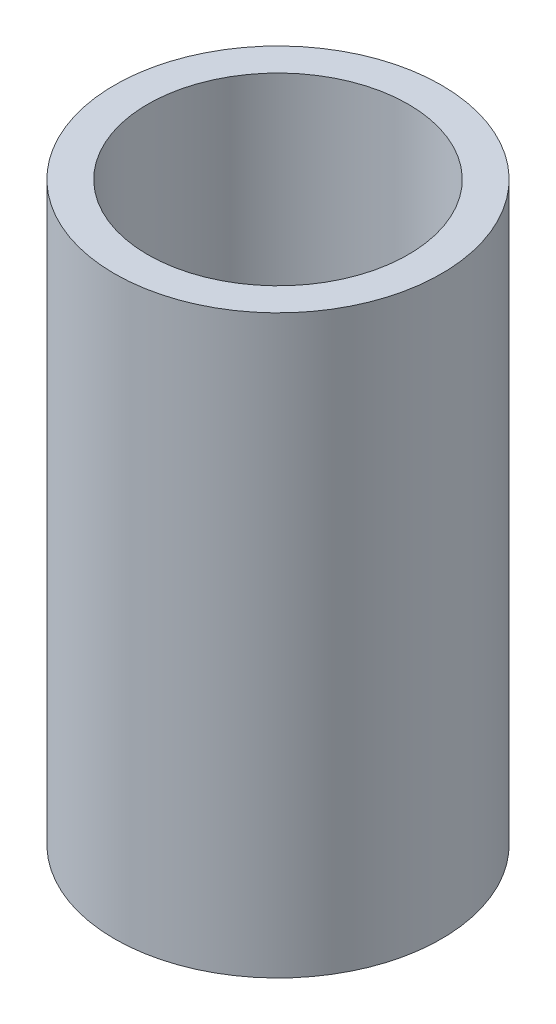
ISO-10303-21;
HEADER;
FILE_DESCRIPTION(('STEP AP214'),'2;1');
FILE_NAME('part.step','',(''),(''),'','','');
FILE_SCHEMA(('AUTOMOTIVE_DESIGN { 1 0 10303 214 1 1 1 1 }'));
ENDSEC;
DATA;
#1=APPLICATION_CONTEXT('core data for automotive mechanical design processes');
#2=APPLICATION_PROTOCOL_DEFINITION('international standard','automotive_design',2000,#1);
#3=PRODUCT_CONTEXT('',#1,'mechanical');
#4=PRODUCT('Part','Part','',(#3));
#5=PRODUCT_RELATED_PRODUCT_CATEGORY('part','',(#4));
#6=PRODUCT_DEFINITION_FORMATION('','',#4);
#7=PRODUCT_DEFINITION_CONTEXT('part definition',#1,'design');
#8=PRODUCT_DEFINITION('design','',#6,#7);
#9=PRODUCT_DEFINITION_SHAPE('','',#8);
#10=(LENGTH_UNIT() NAMED_UNIT(*) SI_UNIT(.MILLI.,.METRE.));
#11=(NAMED_UNIT(*) PLANE_ANGLE_UNIT() SI_UNIT($,.RADIAN.));
#12=(NAMED_UNIT(*) SI_UNIT($,.STERADIAN.) SOLID_ANGLE_UNIT());
#13=UNCERTAINTY_MEASURE_WITH_UNIT(LENGTH_MEASURE(1.E-05),#10,'distance_accuracy_value','');
#14=(GEOMETRIC_REPRESENTATION_CONTEXT(3) GLOBAL_UNCERTAINTY_ASSIGNED_CONTEXT((#13)) GLOBAL_UNIT_ASSIGNED_CONTEXT((#10,
#11,#12)) REPRESENTATION_CONTEXT('',''));
#15=CARTESIAN_POINT('',(0.,0.,0.));
#16=DIRECTION('',(0.,0.,1.));
#17=DIRECTION('',(1.,0.,0.));
#18=AXIS2_PLACEMENT_3D('',#15,#16,#17);
#19=CARTESIAN_POINT('',(0.,70.4902763819376,0.));
#20=DIRECTION('',(0.,-1.,0.));
#21=DIRECTION('',(0.,0.,-1.));
#22=AXIS2_PLACEMENT_3D('',#19,#20,#21);
#23=CYLINDRICAL_SURFACE('',#22,20.);
#24=CARTESIAN_POINT('',(0.,70.4902763819376,0.));
#25=DIRECTION('',(0.,1.,0.));
#26=DIRECTION('',(0.,0.,1.));
#27=AXIS2_PLACEMENT_3D('',#24,#25,#26);
#28=CIRCLE('',#27,20.);
#29=CARTESIAN_POINT('',(0.,70.4902763819376,20.));
#30=VERTEX_POINT('',#29);
#31=EDGE_CURVE('E10',#30,#30,#28,.T.);
#32=ORIENTED_EDGE('',*,*,#31,.F.);
#33=EDGE_LOOP('',(#32));
#34=FACE_BOUND('',#33,.T.);
#35=CARTESIAN_POINT('',(0.,0.,0.));
#36=DIRECTION('',(0.,1.,0.));
#37=DIRECTION('',(0.,0.,1.));
#38=AXIS2_PLACEMENT_3D('',#35,#36,#37);
#39=CIRCLE('',#38,20.);
#40=CARTESIAN_POINT('',(0.,0.,20.));
#41=VERTEX_POINT('',#40);
#42=EDGE_CURVE('E37',#41,#41,#39,.T.);
#43=ORIENTED_EDGE('',*,*,#42,.T.);
#44=EDGE_LOOP('',(#43));
#45=FACE_BOUND('',#44,.T.);
#46=ADVANCED_FACE('F40',(#34,#45),#23,.T.);
#47=CARTESIAN_POINT('',(0.,70.4902763819376,0.));
#48=DIRECTION('',(0.,1.,0.));
#49=DIRECTION('',(0.,0.,1.));
#50=AXIS2_PLACEMENT_3D('',#47,#48,#49);
#51=PLANE('',#50);
#52=CARTESIAN_POINT('',(0.,70.4902763819376,0.));
#53=DIRECTION('',(0.,1.,0.));
#54=DIRECTION('',(0.,0.,1.));
#55=AXIS2_PLACEMENT_3D('',#52,#53,#54);
#56=CIRCLE('',#55,15.947581154964);
#57=CARTESIAN_POINT('',(0.,70.4902763819376,15.947581154964));
#58=VERTEX_POINT('',#57);
#59=EDGE_CURVE('E50',#58,#58,#56,.T.);
#60=ORIENTED_EDGE('',*,*,#59,.F.);
#61=EDGE_LOOP('',(#60));
#62=FACE_BOUND('',#61,.T.);
#63=ORIENTED_EDGE('',*,*,#31,.T.);
#64=EDGE_LOOP('',(#63));
#65=FACE_BOUND('',#64,.T.);
#66=ADVANCED_FACE('F59',(#62,#65),#51,.T.);
#67=CARTESIAN_POINT('',(0.,0.,0.));
#68=DIRECTION('',(0.,1.,0.));
#69=DIRECTION('',(0.,0.,1.));
#70=AXIS2_PLACEMENT_3D('',#67,#68,#69);
#71=PLANE('',#70);
#72=CARTESIAN_POINT('',(0.,0.,0.));
#73=DIRECTION('',(0.,1.,0.));
#74=DIRECTION('',(0.,0.,1.));
#75=AXIS2_PLACEMENT_3D('',#72,#73,#74);
#76=CIRCLE('',#75,15.947581154964);
#77=CARTESIAN_POINT('',(0.,0.,15.947581154964));
#78=VERTEX_POINT('',#77);
#79=EDGE_CURVE('E47',#78,#78,#76,.T.);
#80=ORIENTED_EDGE('',*,*,#79,.T.);
#81=EDGE_LOOP('',(#80));
#82=FACE_BOUND('',#81,.T.);
#83=ORIENTED_EDGE('',*,*,#42,.F.);
#84=EDGE_LOOP('',(#83));
#85=FACE_BOUND('',#84,.T.);
#86=ADVANCED_FACE('F58',(#82,#85),#71,.F.);
#87=CARTESIAN_POINT('',(0.,70.4902763819376,0.));
#88=DIRECTION('',(0.,-1.,0.));
#89=DIRECTION('',(0.,0.,-1.));
#90=AXIS2_PLACEMENT_3D('',#87,#88,#89);
#91=CYLINDRICAL_SURFACE('',#90,15.947581154964);
#92=ORIENTED_EDGE('',*,*,#59,.T.);
#93=EDGE_LOOP('',(#92));
#94=FACE_BOUND('',#93,.T.);
#95=ORIENTED_EDGE('',*,*,#79,.F.);
#96=EDGE_LOOP('',(#95));
#97=FACE_BOUND('',#96,.T.);
#98=ADVANCED_FACE('F54',(#94,#97),#91,.F.);
#99=CLOSED_SHELL('',(#46,#66,#86,#98));
#100=MANIFOLD_SOLID_BREP('B2',#99);
#101=ADVANCED_BREP_SHAPE_REPRESENTATION('',(#18,#100),#14);
#102=SHAPE_DEFINITION_REPRESENTATION(#9,#101);
ENDSEC;
END-ISO-10303-21;
